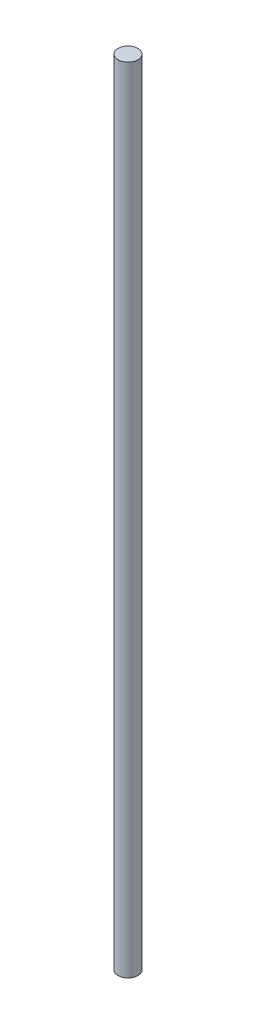
ISO-10303-21;
HEADER;
FILE_DESCRIPTION(('STEP AP214'),'2;1');
FILE_NAME('part.step','',(''),(''),'','','');
FILE_SCHEMA(('AUTOMOTIVE_DESIGN { 1 0 10303 214 1 1 1 1 }'));
ENDSEC;
DATA;
#1=APPLICATION_CONTEXT('core data for automotive mechanical design processes');
#2=APPLICATION_PROTOCOL_DEFINITION('international standard','automotive_design',2000,#1);
#3=PRODUCT_CONTEXT('',#1,'mechanical');
#4=PRODUCT('Part','Part','',(#3));
#5=PRODUCT_RELATED_PRODUCT_CATEGORY('part','',(#4));
#6=PRODUCT_DEFINITION_FORMATION('','',#4);
#7=PRODUCT_DEFINITION_CONTEXT('part definition',#1,'design');
#8=PRODUCT_DEFINITION('design','',#6,#7);
#9=PRODUCT_DEFINITION_SHAPE('','',#8);
#10=(LENGTH_UNIT() NAMED_UNIT(*) SI_UNIT(.MILLI.,.METRE.));
#11=(NAMED_UNIT(*) PLANE_ANGLE_UNIT() SI_UNIT($,.RADIAN.));
#12=(NAMED_UNIT(*) SI_UNIT($,.STERADIAN.) SOLID_ANGLE_UNIT());
#13=UNCERTAINTY_MEASURE_WITH_UNIT(LENGTH_MEASURE(1.E-05),#10,'distance_accuracy_value','');
#14=(GEOMETRIC_REPRESENTATION_CONTEXT(3) GLOBAL_UNCERTAINTY_ASSIGNED_CONTEXT((#13)) GLOBAL_UNIT_ASSIGNED_CONTEXT((#10,
#11,#12)) REPRESENTATION_CONTEXT('',''));
#15=CARTESIAN_POINT('',(0.,0.,0.));
#16=DIRECTION('',(0.,0.,1.));
#17=DIRECTION('',(1.,0.,0.));
#18=AXIS2_PLACEMENT_3D('',#15,#16,#17);
#19=CARTESIAN_POINT('',(195.,550.,32.5));
#20=DIRECTION('',(0.,-1.,0.));
#21=DIRECTION('',(0.,0.,-1.));
#22=AXIS2_PLACEMENT_3D('',#19,#20,#21);
#23=CYLINDRICAL_SURFACE('',#22,4.99999999999999);
#24=CARTESIAN_POINT('',(195.,150.,32.5));
#25=DIRECTION('',(0.,1.,0.));
#26=DIRECTION('',(0.,0.,1.));
#27=AXIS2_PLACEMENT_3D('',#24,#25,#26);
#28=CIRCLE('',#27,4.99999999999999);
#29=CARTESIAN_POINT('',(195.,150.,37.5));
#30=VERTEX_POINT('',#29);
#31=EDGE_CURVE('E40',#30,#30,#28,.F.);
#32=ORIENTED_EDGE('',*,*,#31,.F.);
#33=EDGE_LOOP('',(#32));
#34=FACE_BOUND('',#33,.T.);
#35=CARTESIAN_POINT('',(195.,550.,32.5));
#36=DIRECTION('',(0.,1.,0.));
#37=DIRECTION('',(0.,0.,1.));
#38=AXIS2_PLACEMENT_3D('',#35,#36,#37);
#39=CIRCLE('',#38,4.99999999999999);
#40=CARTESIAN_POINT('',(195.,550.,37.5));
#41=VERTEX_POINT('',#40);
#42=EDGE_CURVE('E11',#41,#41,#39,.T.);
#43=ORIENTED_EDGE('',*,*,#42,.F.);
#44=EDGE_LOOP('',(#43));
#45=FACE_BOUND('',#44,.T.);
#46=ADVANCED_FACE('F34',(#34,#45),#23,.T.);
#47=CARTESIAN_POINT('',(195.,550.,32.5));
#48=DIRECTION('',(0.,1.,0.));
#49=DIRECTION('',(0.,0.,1.));
#50=AXIS2_PLACEMENT_3D('',#47,#48,#49);
#51=PLANE('',#50);
#52=ORIENTED_EDGE('',*,*,#42,.T.);
#53=EDGE_LOOP('',(#52));
#54=FACE_BOUND('',#53,.T.);
#55=ADVANCED_FACE('F50',(#54),#51,.T.);
#56=CARTESIAN_POINT('',(195.,150.,32.5));
#57=DIRECTION('',(0.,1.,0.));
#58=DIRECTION('',(0.,0.,1.));
#59=AXIS2_PLACEMENT_3D('',#56,#57,#58);
#60=PLANE('',#59);
#61=ORIENTED_EDGE('',*,*,#31,.T.);
#62=EDGE_LOOP('',(#61));
#63=FACE_BOUND('',#62,.T.);
#64=ADVANCED_FACE('F46',(#63),#60,.F.);
#65=CLOSED_SHELL('',(#46,#55,#64));
#66=MANIFOLD_SOLID_BREP('B2',#65);
#67=ADVANCED_BREP_SHAPE_REPRESENTATION('',(#18,#66),#14);
#68=SHAPE_DEFINITION_REPRESENTATION(#9,#67);
ENDSEC;
END-ISO-10303-21;
